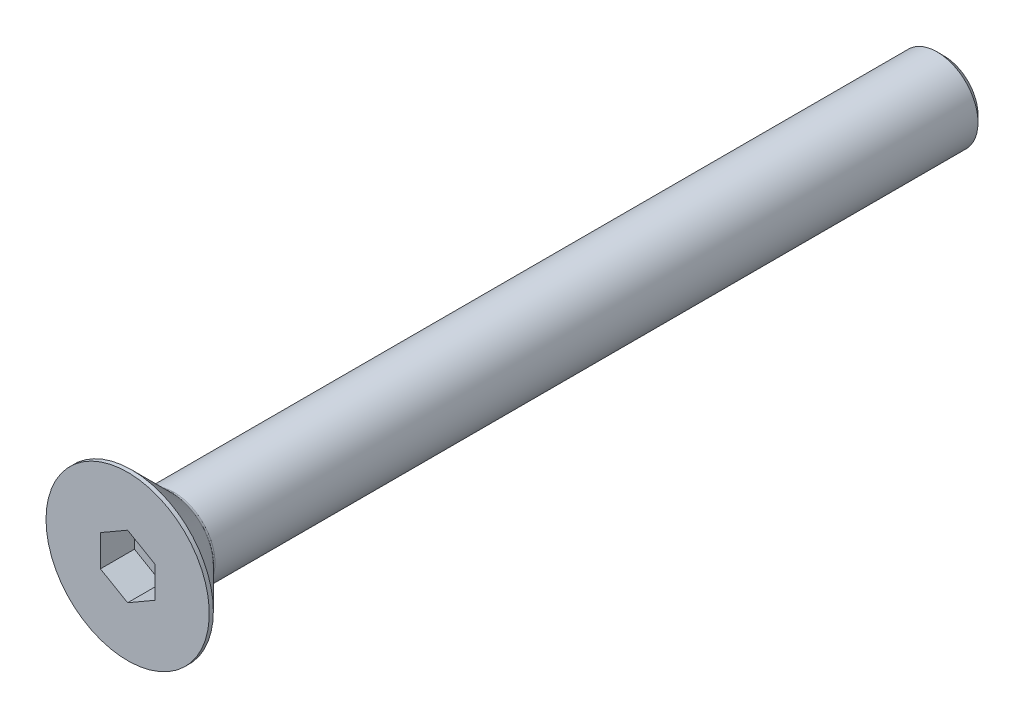
ISO-10303-21;
HEADER;
FILE_DESCRIPTION(('STEP AP214'),'2;1');
FILE_NAME('part.step','',(''),(''),'','','');
FILE_SCHEMA(('AUTOMOTIVE_DESIGN { 1 0 10303 214 1 1 1 1 }'));
ENDSEC;
DATA;
#1=APPLICATION_CONTEXT('core data for automotive mechanical design processes');
#2=APPLICATION_PROTOCOL_DEFINITION('international standard','automotive_design',2000,#1);
#3=PRODUCT_CONTEXT('',#1,'mechanical');
#4=PRODUCT('Part','Part','',(#3));
#5=PRODUCT_RELATED_PRODUCT_CATEGORY('part','',(#4));
#6=PRODUCT_DEFINITION_FORMATION('','',#4);
#7=PRODUCT_DEFINITION_CONTEXT('part definition',#1,'design');
#8=PRODUCT_DEFINITION('design','',#6,#7);
#9=PRODUCT_DEFINITION_SHAPE('','',#8);
#10=(LENGTH_UNIT() NAMED_UNIT(*) SI_UNIT(.MILLI.,.METRE.));
#11=(NAMED_UNIT(*) PLANE_ANGLE_UNIT() SI_UNIT($,.RADIAN.));
#12=(NAMED_UNIT(*) SI_UNIT($,.STERADIAN.) SOLID_ANGLE_UNIT());
#13=UNCERTAINTY_MEASURE_WITH_UNIT(LENGTH_MEASURE(1.E-05),#10,'distance_accuracy_value','');
#14=(GEOMETRIC_REPRESENTATION_CONTEXT(3) GLOBAL_UNCERTAINTY_ASSIGNED_CONTEXT((#13)) GLOBAL_UNIT_ASSIGNED_CONTEXT((#10,
#11,#12)) REPRESENTATION_CONTEXT('',''));
#15=CARTESIAN_POINT('',(0.,0.,0.));
#16=DIRECTION('',(0.,0.,1.));
#17=DIRECTION('',(1.,0.,0.));
#18=AXIS2_PLACEMENT_3D('',#15,#16,#17);
#19=CARTESIAN_POINT('',(0.,0.,-2.5));
#20=DIRECTION('',(0.,0.,1.));
#21=DIRECTION('',(1.,0.,0.));
#22=AXIS2_PLACEMENT_3D('',#19,#20,#21);
#23=PLANE('',#22);
#24=DIRECTION('',(-0.866025403784439,-0.5,0.));
#25=VECTOR('',#24,1.);
#26=CARTESIAN_POINT('',(0.,2.3094010767585,-2.5));
#27=LINE('',#26,#25);
#28=CARTESIAN_POINT('',(0.,2.3094010767585,-2.5));
#29=VERTEX_POINT('',#28);
#30=CARTESIAN_POINT('',(-2.,1.15470053837925,-2.5));
#31=VERTEX_POINT('',#30);
#32=EDGE_CURVE('E82',#29,#31,#27,.T.);
#33=ORIENTED_EDGE('',*,*,#32,.T.);
#34=DIRECTION('',(0.,1.,0.));
#35=VECTOR('',#34,1.);
#36=CARTESIAN_POINT('',(-2.,1.15470053837925,-2.5));
#37=LINE('',#36,#35);
#38=CARTESIAN_POINT('',(-2.,-1.15470053837925,-2.5));
#39=VERTEX_POINT('',#38);
#40=EDGE_CURVE('E66',#31,#39,#37,.F.);
#41=ORIENTED_EDGE('',*,*,#40,.T.);
#42=DIRECTION('',(0.866025403784439,-0.499999999999999,0.));
#43=VECTOR('',#42,1.);
#44=CARTESIAN_POINT('',(-2.,-1.15470053837925,-2.5));
#45=LINE('',#44,#43);
#46=CARTESIAN_POINT('',(0.,-2.3094010767585,-2.5));
#47=VERTEX_POINT('',#46);
#48=EDGE_CURVE('E71',#39,#47,#45,.T.);
#49=ORIENTED_EDGE('',*,*,#48,.T.);
#50=DIRECTION('',(0.866025403784439,0.5,0.));
#51=VECTOR('',#50,1.);
#52=CARTESIAN_POINT('',(0.,-2.3094010767585,-2.5));
#53=LINE('',#52,#51);
#54=CARTESIAN_POINT('',(2.,-1.15470053837925,-2.5));
#55=VERTEX_POINT('',#54);
#56=EDGE_CURVE('E128',#47,#55,#53,.T.);
#57=ORIENTED_EDGE('',*,*,#56,.T.);
#58=DIRECTION('',(0.,1.,0.));
#59=VECTOR('',#58,1.);
#60=CARTESIAN_POINT('',(2.,-1.15470053837925,-2.5));
#61=LINE('',#60,#59);
#62=CARTESIAN_POINT('',(2.,1.15470053837925,-2.5));
#63=VERTEX_POINT('',#62);
#64=EDGE_CURVE('E132',#55,#63,#61,.T.);
#65=ORIENTED_EDGE('',*,*,#64,.T.);
#66=DIRECTION('',(-0.866025403784439,0.499999999999999,0.));
#67=VECTOR('',#66,1.);
#68=CARTESIAN_POINT('',(2.,1.15470053837925,-2.5));
#69=LINE('',#68,#67);
#70=EDGE_CURVE('E137',#63,#29,#69,.T.);
#71=ORIENTED_EDGE('',*,*,#70,.T.);
#72=EDGE_LOOP('',(#33,#41,#49,#57,#65,#71));
#73=FACE_BOUND('',#72,.T.);
#74=ADVANCED_FACE('F15',(#73),#23,.T.);
#75=CARTESIAN_POINT('',(-2.,-1.15470053837925,0.));
#76=DIRECTION('',(-0.499999999999999,-0.866025403784439,0.));
#77=DIRECTION('',(0.866025403784439,-0.499999999999999,0.));
#78=AXIS2_PLACEMENT_3D('',#75,#76,#77);
#79=PLANE('',#78);
#80=DIRECTION('',(0.,0.,1.));
#81=VECTOR('',#80,1.);
#82=CARTESIAN_POINT('',(-2.,-1.15470053837925,0.));
#83=LINE('',#82,#81);
#84=CARTESIAN_POINT('',(-2.,-1.15470053837925,0.));
#85=VERTEX_POINT('',#84);
#86=EDGE_CURVE('E73',#39,#85,#83,.T.);
#87=ORIENTED_EDGE('',*,*,#86,.T.);
#88=DIRECTION('',(-0.866025403784439,0.499999999999999,0.));
#89=VECTOR('',#88,1.);
#90=CARTESIAN_POINT('',(0.,-2.3094010767585,0.));
#91=LINE('',#90,#89);
#92=CARTESIAN_POINT('',(0.,-2.3094010767585,0.));
#93=VERTEX_POINT('',#92);
#94=EDGE_CURVE('E126',#93,#85,#91,.T.);
#95=ORIENTED_EDGE('',*,*,#94,.F.);
#96=DIRECTION('',(0.,0.,1.));
#97=VECTOR('',#96,1.);
#98=CARTESIAN_POINT('',(0.,-2.3094010767585,0.));
#99=LINE('',#98,#97);
#100=EDGE_CURVE('E76',#93,#47,#99,.F.);
#101=ORIENTED_EDGE('',*,*,#100,.T.);
#102=ORIENTED_EDGE('',*,*,#48,.F.);
#103=EDGE_LOOP('',(#87,#95,#101,#102));
#104=FACE_BOUND('',#103,.T.);
#105=ADVANCED_FACE('F72',(#104),#79,.F.);
#106=CARTESIAN_POINT('',(-2.,1.15470053837925,0.));
#107=DIRECTION('',(-1.,0.,0.));
#108=DIRECTION('',(0.,0.,1.));
#109=AXIS2_PLACEMENT_3D('',#106,#107,#108);
#110=PLANE('',#109);
#111=DIRECTION('',(0.,0.,1.));
#112=VECTOR('',#111,1.);
#113=CARTESIAN_POINT('',(-2.,1.15470053837925,0.));
#114=LINE('',#113,#112);
#115=CARTESIAN_POINT('',(-2.,1.15470053837925,0.));
#116=VERTEX_POINT('',#115);
#117=EDGE_CURVE('E84',#31,#116,#114,.T.);
#118=ORIENTED_EDGE('',*,*,#117,.T.);
#119=DIRECTION('',(0.,1.,0.));
#120=VECTOR('',#119,1.);
#121=CARTESIAN_POINT('',(-2.,0.,0.));
#122=LINE('',#121,#120);
#123=EDGE_CURVE('E88',#85,#116,#122,.T.);
#124=ORIENTED_EDGE('',*,*,#123,.F.);
#125=ORIENTED_EDGE('',*,*,#86,.F.);
#126=ORIENTED_EDGE('',*,*,#40,.F.);
#127=EDGE_LOOP('',(#118,#124,#125,#126));
#128=FACE_BOUND('',#127,.T.);
#129=ADVANCED_FACE('F86',(#128),#110,.F.);
#130=CARTESIAN_POINT('',(0.,2.3094010767585,0.));
#131=DIRECTION('',(-0.5,0.866025403784439,0.));
#132=DIRECTION('',(-0.866025403784439,-0.5,0.));
#133=AXIS2_PLACEMENT_3D('',#130,#131,#132);
#134=PLANE('',#133);
#135=DIRECTION('',(0.,0.,1.));
#136=VECTOR('',#135,1.);
#137=CARTESIAN_POINT('',(0.,2.3094010767585,0.));
#138=LINE('',#137,#136);
#139=CARTESIAN_POINT('',(0.,2.3094010767585,0.));
#140=VERTEX_POINT('',#139);
#141=EDGE_CURVE('E139',#29,#140,#138,.T.);
#142=ORIENTED_EDGE('',*,*,#141,.T.);
#143=DIRECTION('',(0.866025403784439,0.5,0.));
#144=VECTOR('',#143,1.);
#145=CARTESIAN_POINT('',(-2.,1.15470053837925,0.));
#146=LINE('',#145,#144);
#147=EDGE_CURVE('E122',#116,#140,#146,.T.);
#148=ORIENTED_EDGE('',*,*,#147,.F.);
#149=ORIENTED_EDGE('',*,*,#117,.F.);
#150=ORIENTED_EDGE('',*,*,#32,.F.);
#151=EDGE_LOOP('',(#142,#148,#149,#150));
#152=FACE_BOUND('',#151,.T.);
#153=ADVANCED_FACE('F143',(#152),#134,.F.);
#154=CARTESIAN_POINT('',(2.,1.15470053837925,0.));
#155=DIRECTION('',(0.499999999999999,0.866025403784439,0.));
#156=DIRECTION('',(-0.866025403784439,0.499999999999999,0.));
#157=AXIS2_PLACEMENT_3D('',#154,#155,#156);
#158=PLANE('',#157);
#159=DIRECTION('',(0.,0.,-1.));
#160=VECTOR('',#159,1.);
#161=CARTESIAN_POINT('',(2.,1.15470053837925,0.));
#162=LINE('',#161,#160);
#163=CARTESIAN_POINT('',(2.,1.15470053837925,0.));
#164=VERTEX_POINT('',#163);
#165=EDGE_CURVE('E135',#63,#164,#162,.F.);
#166=ORIENTED_EDGE('',*,*,#165,.T.);
#167=DIRECTION('',(0.866025403784439,-0.499999999999999,0.));
#168=VECTOR('',#167,1.);
#169=CARTESIAN_POINT('',(0.,2.3094010767585,0.));
#170=LINE('',#169,#168);
#171=EDGE_CURVE('E119',#140,#164,#170,.T.);
#172=ORIENTED_EDGE('',*,*,#171,.F.);
#173=ORIENTED_EDGE('',*,*,#141,.F.);
#174=ORIENTED_EDGE('',*,*,#70,.F.);
#175=EDGE_LOOP('',(#166,#172,#173,#174));
#176=FACE_BOUND('',#175,.T.);
#177=ADVANCED_FACE('F154',(#176),#158,.F.);
#178=CARTESIAN_POINT('',(2.,-1.15470053837925,0.));
#179=DIRECTION('',(1.,0.,0.));
#180=DIRECTION('',(0.,0.,-1.));
#181=AXIS2_PLACEMENT_3D('',#178,#179,#180);
#182=PLANE('',#181);
#183=DIRECTION('',(0.,0.,1.));
#184=VECTOR('',#183,1.);
#185=CARTESIAN_POINT('',(2.,-1.15470053837925,0.));
#186=LINE('',#185,#184);
#187=CARTESIAN_POINT('',(2.,-1.15470053837925,0.));
#188=VERTEX_POINT('',#187);
#189=EDGE_CURVE('E34',#55,#188,#186,.T.);
#190=ORIENTED_EDGE('',*,*,#189,.T.);
#191=DIRECTION('',(0.,1.,0.));
#192=VECTOR('',#191,1.);
#193=CARTESIAN_POINT('',(2.,0.,0.));
#194=LINE('',#193,#192);
#195=EDGE_CURVE('E116',#164,#188,#194,.F.);
#196=ORIENTED_EDGE('',*,*,#195,.F.);
#197=ORIENTED_EDGE('',*,*,#165,.F.);
#198=ORIENTED_EDGE('',*,*,#64,.F.);
#199=EDGE_LOOP('',(#190,#196,#197,#198));
#200=FACE_BOUND('',#199,.T.);
#201=ADVANCED_FACE('F152',(#200),#182,.F.);
#202=CARTESIAN_POINT('',(0.,-2.3094010767585,0.));
#203=DIRECTION('',(0.5,-0.866025403784439,0.));
#204=DIRECTION('',(0.866025403784439,0.5,0.));
#205=AXIS2_PLACEMENT_3D('',#202,#203,#204);
#206=PLANE('',#205);
#207=ORIENTED_EDGE('',*,*,#100,.F.);
#208=DIRECTION('',(-0.866025403784439,-0.5,0.));
#209=VECTOR('',#208,1.);
#210=CARTESIAN_POINT('',(2.,-1.15470053837925,0.));
#211=LINE('',#210,#209);
#212=EDGE_CURVE('E113',#188,#93,#211,.T.);
#213=ORIENTED_EDGE('',*,*,#212,.F.);
#214=ORIENTED_EDGE('',*,*,#189,.F.);
#215=ORIENTED_EDGE('',*,*,#56,.F.);
#216=EDGE_LOOP('',(#207,#213,#214,#215));
#217=FACE_BOUND('',#216,.T.);
#218=ADVANCED_FACE('F150',(#217),#206,.F.);
#219=CARTESIAN_POINT('',(3.,0.,0.));
#220=DIRECTION('',(0.,0.,1.));
#221=DIRECTION('',(1.,0.,0.));
#222=AXIS2_PLACEMENT_3D('',#219,#220,#221);
#223=PLANE('',#222);
#224=ORIENTED_EDGE('',*,*,#195,.T.);
#225=ORIENTED_EDGE('',*,*,#212,.T.);
#226=ORIENTED_EDGE('',*,*,#94,.T.);
#227=ORIENTED_EDGE('',*,*,#123,.T.);
#228=ORIENTED_EDGE('',*,*,#147,.T.);
#229=ORIENTED_EDGE('',*,*,#171,.T.);
#230=EDGE_LOOP('',(#224,#225,#226,#227,#228,#229));
#231=FACE_BOUND('',#230,.T.);
#232=CARTESIAN_POINT('',(0.,0.,0.));
#233=DIRECTION('',(0.,0.,-1.));
#234=DIRECTION('',(-1.,0.,0.));
#235=AXIS2_PLACEMENT_3D('',#232,#233,#234);
#236=CIRCLE('',#235,6.);
#237=CARTESIAN_POINT('',(-6.,0.,0.));
#238=VERTEX_POINT('',#237);
#239=EDGE_CURVE('E19',#238,#238,#236,.T.);
#240=ORIENTED_EDGE('',*,*,#239,.F.);
#241=EDGE_LOOP('',(#240));
#242=FACE_BOUND('',#241,.T.);
#243=ADVANCED_FACE('F147',(#231,#242),#223,.T.);
#244=CARTESIAN_POINT('',(0.,0.,-0.149999999999997));
#245=DIRECTION('',(0.,0.,-1.));
#246=DIRECTION('',(-1.,0.,0.));
#247=AXIS2_PLACEMENT_3D('',#244,#245,#246);
#248=CYLINDRICAL_SURFACE('',#247,6.);
#249=ORIENTED_EDGE('',*,*,#239,.T.);
#250=EDGE_LOOP('',(#249));
#251=FACE_BOUND('',#250,.T.);
#252=CARTESIAN_POINT('',(0.,0.,-0.299999998617295));
#253=DIRECTION('',(0.,0.,1.));
#254=DIRECTION('',(1.,0.,0.));
#255=AXIS2_PLACEMENT_3D('',#252,#253,#254);
#256=CIRCLE('',#255,5.99999999872125);
#257=CARTESIAN_POINT('',(5.99999999872125,0.,-0.299999998617295));
#258=VERTEX_POINT('',#257);
#259=EDGE_CURVE('E100',#258,#258,#256,.F.);
#260=ORIENTED_EDGE('',*,*,#259,.F.);
#261=EDGE_LOOP('',(#260));
#262=FACE_BOUND('',#261,.T.);
#263=ADVANCED_FACE('F183',(#251,#262),#248,.T.);
#264=CARTESIAN_POINT('',(0.,0.,-0.299999998617295));
#265=DIRECTION('',(0.,0.,1.));
#266=DIRECTION('',(1.,0.,0.));
#267=AXIS2_PLACEMENT_3D('',#264,#265,#266);
#268=CONICAL_SURFACE('',#267,5.99999999872125,0.78539816249955);
#269=CARTESIAN_POINT('',(0.,0.,-3.21213203435597));
#270=DIRECTION('',(0.,0.,-1.));
#271=DIRECTION('',(0.,1.,0.));
#272=AXIS2_PLACEMENT_3D('',#269,#270,#271);
#273=CIRCLE('',#272,3.08786796564404);
#274=CARTESIAN_POINT('',(0.,3.08786796564404,-3.21213203435597));
#275=VERTEX_POINT('',#274);
#276=EDGE_CURVE('E94',#275,#275,#273,.T.);
#277=ORIENTED_EDGE('',*,*,#276,.F.);
#278=EDGE_LOOP('',(#277));
#279=FACE_BOUND('',#278,.T.);
#280=ORIENTED_EDGE('',*,*,#259,.T.);
#281=EDGE_LOOP('',(#280));
#282=FACE_BOUND('',#281,.T.);
#283=ADVANCED_FACE('F179',(#279,#282),#268,.T.);
#284=CARTESIAN_POINT('',(1.5,0.,-60.));
#285=DIRECTION('',(0.,0.,-1.));
#286=DIRECTION('',(-1.,0.,0.));
#287=AXIS2_PLACEMENT_3D('',#284,#285,#286);
#288=PLANE('',#287);
#289=CARTESIAN_POINT('',(0.,0.,-60.0000000002296));
#290=DIRECTION('',(0.,0.,1.));
#291=DIRECTION('',(1.,0.,0.));
#292=AXIS2_PLACEMENT_3D('',#289,#290,#291);
#293=CIRCLE('',#292,2.5000000002251);
#294=CARTESIAN_POINT('',(2.5000000002251,0.,-60.0000000002296));
#295=VERTEX_POINT('',#294);
#296=EDGE_CURVE('E92',#295,#295,#293,.T.);
#297=ORIENTED_EDGE('',*,*,#296,.F.);
#298=EDGE_LOOP('',(#297));
#299=FACE_BOUND('',#298,.T.);
#300=ADVANCED_FACE('F176',(#299),#288,.T.);
#301=CARTESIAN_POINT('',(0.,0.,-3.42426406871193));
#302=DIRECTION('',(0.,0.,-1.));
#303=DIRECTION('',(0.,1.,0.));
#304=AXIS2_PLACEMENT_3D('',#301,#302,#303);
#305=TOROIDAL_SURFACE('',#304,3.3,0.3);
#306=CARTESIAN_POINT('',(0.,0.,-3.42426406871193));
#307=DIRECTION('',(0.,0.,-1.));
#308=DIRECTION('',(-1.,0.,0.));
#309=AXIS2_PLACEMENT_3D('',#306,#307,#308);
#310=CIRCLE('',#309,3.);
#311=CARTESIAN_POINT('',(-3.,0.,-3.42426406871193));
#312=VERTEX_POINT('',#311);
#313=EDGE_CURVE('E25',#312,#312,#310,.T.);
#314=ORIENTED_EDGE('',*,*,#313,.F.);
#315=EDGE_LOOP('',(#314));
#316=FACE_BOUND('',#315,.T.);
#317=ORIENTED_EDGE('',*,*,#276,.T.);
#318=EDGE_LOOP('',(#317));
#319=FACE_BOUND('',#318,.T.);
#320=ADVANCED_FACE('F17',(#316,#319),#305,.F.);
#321=CARTESIAN_POINT('',(0.,0.,-59.4999999998436));
#322=DIRECTION('',(0.,0.,1.));
#323=DIRECTION('',(1.,0.,0.));
#324=AXIS2_PLACEMENT_3D('',#321,#322,#323);
#325=CONICAL_SURFACE('',#324,2.99999999970169,0.785398162487954);
#326=ORIENTED_EDGE('',*,*,#296,.T.);
#327=EDGE_LOOP('',(#326));
#328=FACE_BOUND('',#327,.T.);
#329=CARTESIAN_POINT('',(0.,0.,-59.5));
#330=DIRECTION('',(0.,0.,-1.));
#331=DIRECTION('',(-1.,0.,0.));
#332=AXIS2_PLACEMENT_3D('',#329,#330,#331);
#333=CIRCLE('',#332,3.);
#334=CARTESIAN_POINT('',(-3.,0.,-59.5));
#335=VERTEX_POINT('',#334);
#336=EDGE_CURVE('E10',#335,#335,#333,.F.);
#337=ORIENTED_EDGE('',*,*,#336,.F.);
#338=EDGE_LOOP('',(#337));
#339=FACE_BOUND('',#338,.T.);
#340=ADVANCED_FACE('F166',(#328,#339),#325,.T.);
#341=CARTESIAN_POINT('',(0.,0.,-31.65));
#342=DIRECTION('',(0.,0.,-1.));
#343=DIRECTION('',(-1.,0.,0.));
#344=AXIS2_PLACEMENT_3D('',#341,#342,#343);
#345=CYLINDRICAL_SURFACE('',#344,3.);
#346=ORIENTED_EDGE('',*,*,#336,.T.);
#347=EDGE_LOOP('',(#346));
#348=FACE_BOUND('',#347,.T.);
#349=ORIENTED_EDGE('',*,*,#313,.T.);
#350=EDGE_LOOP('',(#349));
#351=FACE_BOUND('',#350,.T.);
#352=ADVANCED_FACE('F164',(#348,#351),#345,.T.);
#353=CLOSED_SHELL('',(#74,#105,#129,#153,#177,#201,#218,#243,#263,#283,#300,#320,#340,#352));
#354=MANIFOLD_SOLID_BREP('B1',#353);
#355=ADVANCED_BREP_SHAPE_REPRESENTATION('',(#18,#354),#14);
#356=SHAPE_DEFINITION_REPRESENTATION(#9,#355);
ENDSEC;
END-ISO-10303-21;
